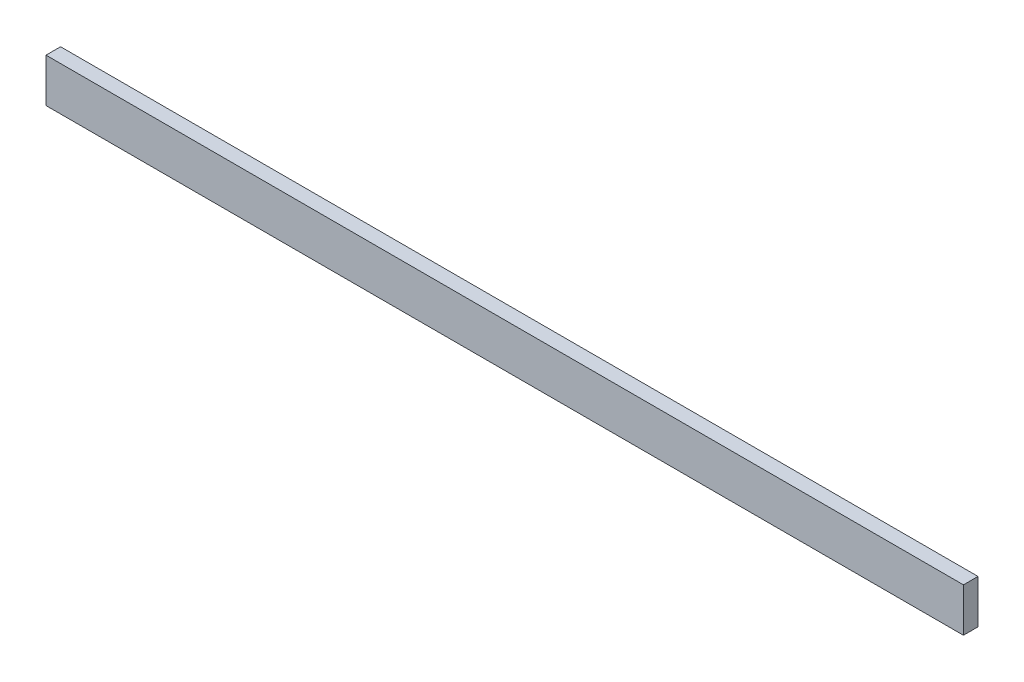
ISO-10303-21;
HEADER;
FILE_DESCRIPTION(('STEP AP214'),'2;1');
FILE_NAME('part.step','',(''),(''),'','','');
FILE_SCHEMA(('AUTOMOTIVE_DESIGN { 1 0 10303 214 1 1 1 1 }'));
ENDSEC;
DATA;
#1=APPLICATION_CONTEXT('core data for automotive mechanical design processes');
#2=APPLICATION_PROTOCOL_DEFINITION('international standard','automotive_design',2000,#1);
#3=PRODUCT_CONTEXT('',#1,'mechanical');
#4=PRODUCT('Part','Part','',(#3));
#5=PRODUCT_RELATED_PRODUCT_CATEGORY('part','',(#4));
#6=PRODUCT_DEFINITION_FORMATION('','',#4);
#7=PRODUCT_DEFINITION_CONTEXT('part definition',#1,'design');
#8=PRODUCT_DEFINITION('design','',#6,#7);
#9=PRODUCT_DEFINITION_SHAPE('','',#8);
#10=(LENGTH_UNIT() NAMED_UNIT(*) SI_UNIT(.MILLI.,.METRE.));
#11=(NAMED_UNIT(*) PLANE_ANGLE_UNIT() SI_UNIT($,.RADIAN.));
#12=(NAMED_UNIT(*) SI_UNIT($,.STERADIAN.) SOLID_ANGLE_UNIT());
#13=UNCERTAINTY_MEASURE_WITH_UNIT(LENGTH_MEASURE(1.E-05),#10,'distance_accuracy_value','');
#14=(GEOMETRIC_REPRESENTATION_CONTEXT(3) GLOBAL_UNCERTAINTY_ASSIGNED_CONTEXT((#13)) GLOBAL_UNIT_ASSIGNED_CONTEXT((#10,
#11,#12)) REPRESENTATION_CONTEXT('',''));
#15=CARTESIAN_POINT('',(0.,0.,0.));
#16=DIRECTION('',(0.,0.,1.));
#17=DIRECTION('',(1.,0.,0.));
#18=AXIS2_PLACEMENT_3D('',#15,#16,#17);
#19=CARTESIAN_POINT('',(0.,0.,6.35));
#20=DIRECTION('',(-1.,0.,0.));
#21=DIRECTION('',(0.,0.,1.));
#22=AXIS2_PLACEMENT_3D('',#19,#20,#21);
#23=PLANE('',#22);
#24=DIRECTION('',(0.,1.,0.));
#25=VECTOR('',#24,1.);
#26=CARTESIAN_POINT('',(0.,0.,0.));
#27=LINE('',#26,#25);
#28=CARTESIAN_POINT('',(0.,0.,0.));
#29=VERTEX_POINT('',#28);
#30=CARTESIAN_POINT('',(0.,19.05,0.));
#31=VERTEX_POINT('',#30);
#32=EDGE_CURVE('E110',#29,#31,#27,.T.);
#33=ORIENTED_EDGE('',*,*,#32,.F.);
#34=DIRECTION('',(0.,0.,-1.));
#35=VECTOR('',#34,1.);
#36=CARTESIAN_POINT('',(0.,0.,6.35));
#37=LINE('',#36,#35);
#38=CARTESIAN_POINT('',(0.,0.,6.35));
#39=VERTEX_POINT('',#38);
#40=EDGE_CURVE('E11',#39,#29,#37,.T.);
#41=ORIENTED_EDGE('',*,*,#40,.F.);
#42=DIRECTION('',(0.,1.,0.));
#43=VECTOR('',#42,1.);
#44=CARTESIAN_POINT('',(0.,0.,6.35));
#45=LINE('',#44,#43);
#46=CARTESIAN_POINT('',(0.,19.05,6.35));
#47=VERTEX_POINT('',#46);
#48=EDGE_CURVE('E103',#39,#47,#45,.T.);
#49=ORIENTED_EDGE('',*,*,#48,.T.);
#50=DIRECTION('',(0.,0.,-1.));
#51=VECTOR('',#50,1.);
#52=CARTESIAN_POINT('',(0.,19.05,6.35));
#53=LINE('',#52,#51);
#54=EDGE_CURVE('E42',#47,#31,#53,.T.);
#55=ORIENTED_EDGE('',*,*,#54,.T.);
#56=EDGE_LOOP('',(#33,#41,#49,#55));
#57=FACE_BOUND('',#56,.T.);
#58=ADVANCED_FACE('F39',(#57),#23,.T.);
#59=CARTESIAN_POINT('',(0.,0.,6.35));
#60=DIRECTION('',(0.,1.,0.));
#61=DIRECTION('',(0.,0.,1.));
#62=AXIS2_PLACEMENT_3D('',#59,#60,#61);
#63=PLANE('',#62);
#64=DIRECTION('',(1.,0.,0.));
#65=VECTOR('',#64,1.);
#66=CARTESIAN_POINT('',(0.,0.,0.));
#67=LINE('',#66,#65);
#68=CARTESIAN_POINT('',(400.05,0.,0.));
#69=VERTEX_POINT('',#68);
#70=EDGE_CURVE('E73',#29,#69,#67,.T.);
#71=ORIENTED_EDGE('',*,*,#70,.T.);
#72=DIRECTION('',(0.,0.,-1.));
#73=VECTOR('',#72,1.);
#74=CARTESIAN_POINT('',(400.05,0.,6.35));
#75=LINE('',#74,#73);
#76=CARTESIAN_POINT('',(400.05,0.,6.35));
#77=VERTEX_POINT('',#76);
#78=EDGE_CURVE('E49',#77,#69,#75,.T.);
#79=ORIENTED_EDGE('',*,*,#78,.F.);
#80=DIRECTION('',(1.,0.,0.));
#81=VECTOR('',#80,1.);
#82=CARTESIAN_POINT('',(0.,0.,6.35));
#83=LINE('',#82,#81);
#84=EDGE_CURVE('E90',#39,#77,#83,.T.);
#85=ORIENTED_EDGE('',*,*,#84,.F.);
#86=ORIENTED_EDGE('',*,*,#40,.T.);
#87=EDGE_LOOP('',(#71,#79,#85,#86));
#88=FACE_BOUND('',#87,.T.);
#89=ADVANCED_FACE('F126',(#88),#63,.F.);
#90=CARTESIAN_POINT('',(400.05,0.,6.35));
#91=DIRECTION('',(-1.,0.,0.));
#92=DIRECTION('',(0.,0.,1.));
#93=AXIS2_PLACEMENT_3D('',#90,#91,#92);
#94=PLANE('',#93);
#95=DIRECTION('',(0.,1.,0.));
#96=VECTOR('',#95,1.);
#97=CARTESIAN_POINT('',(400.05,0.,0.));
#98=LINE('',#97,#96);
#99=CARTESIAN_POINT('',(400.05,19.05,0.));
#100=VERTEX_POINT('',#99);
#101=EDGE_CURVE('E98',#69,#100,#98,.T.);
#102=ORIENTED_EDGE('',*,*,#101,.T.);
#103=DIRECTION('',(0.,0.,-1.));
#104=VECTOR('',#103,1.);
#105=CARTESIAN_POINT('',(400.05,19.05,6.35));
#106=LINE('',#105,#104);
#107=CARTESIAN_POINT('',(400.05,19.05,6.35));
#108=VERTEX_POINT('',#107);
#109=EDGE_CURVE('E95',#108,#100,#106,.T.);
#110=ORIENTED_EDGE('',*,*,#109,.F.);
#111=DIRECTION('',(0.,1.,0.));
#112=VECTOR('',#111,1.);
#113=CARTESIAN_POINT('',(400.05,0.,6.35));
#114=LINE('',#113,#112);
#115=EDGE_CURVE('E85',#77,#108,#114,.T.);
#116=ORIENTED_EDGE('',*,*,#115,.F.);
#117=ORIENTED_EDGE('',*,*,#78,.T.);
#118=EDGE_LOOP('',(#102,#110,#116,#117));
#119=FACE_BOUND('',#118,.T.);
#120=ADVANCED_FACE('F96',(#119),#94,.F.);
#121=CARTESIAN_POINT('',(0.,19.05,6.35));
#122=DIRECTION('',(0.,1.,0.));
#123=DIRECTION('',(0.,0.,1.));
#124=AXIS2_PLACEMENT_3D('',#121,#122,#123);
#125=PLANE('',#124);
#126=DIRECTION('',(1.,0.,0.));
#127=VECTOR('',#126,1.);
#128=CARTESIAN_POINT('',(0.,19.05,0.));
#129=LINE('',#128,#127);
#130=EDGE_CURVE('E114',#31,#100,#129,.T.);
#131=ORIENTED_EDGE('',*,*,#130,.F.);
#132=ORIENTED_EDGE('',*,*,#54,.F.);
#133=DIRECTION('',(1.,0.,0.));
#134=VECTOR('',#133,1.);
#135=CARTESIAN_POINT('',(0.,19.05,6.35));
#136=LINE('',#135,#134);
#137=EDGE_CURVE('E89',#47,#108,#136,.T.);
#138=ORIENTED_EDGE('',*,*,#137,.T.);
#139=ORIENTED_EDGE('',*,*,#109,.T.);
#140=EDGE_LOOP('',(#131,#132,#138,#139));
#141=FACE_BOUND('',#140,.T.);
#142=ADVANCED_FACE('F101',(#141),#125,.T.);
#143=CARTESIAN_POINT('',(0.,0.,6.35));
#144=DIRECTION('',(0.,0.,-1.));
#145=DIRECTION('',(-1.,0.,0.));
#146=AXIS2_PLACEMENT_3D('',#143,#144,#145);
#147=PLANE('',#146);
#148=ORIENTED_EDGE('',*,*,#48,.F.);
#149=ORIENTED_EDGE('',*,*,#84,.T.);
#150=ORIENTED_EDGE('',*,*,#115,.T.);
#151=ORIENTED_EDGE('',*,*,#137,.F.);
#152=EDGE_LOOP('',(#148,#149,#150,#151));
#153=FACE_BOUND('',#152,.T.);
#154=ADVANCED_FACE('F88',(#153),#147,.F.);
#155=CARTESIAN_POINT('',(0.,0.,0.));
#156=DIRECTION('',(0.,0.,-1.));
#157=DIRECTION('',(-1.,0.,0.));
#158=AXIS2_PLACEMENT_3D('',#155,#156,#157);
#159=PLANE('',#158);
#160=ORIENTED_EDGE('',*,*,#32,.T.);
#161=ORIENTED_EDGE('',*,*,#130,.T.);
#162=ORIENTED_EDGE('',*,*,#101,.F.);
#163=ORIENTED_EDGE('',*,*,#70,.F.);
#164=EDGE_LOOP('',(#160,#161,#162,#163));
#165=FACE_BOUND('',#164,.T.);
#166=ADVANCED_FACE('F123',(#165),#159,.T.);
#167=CLOSED_SHELL('',(#58,#89,#120,#142,#154,#166));
#168=MANIFOLD_SOLID_BREP('B2',#167);
#169=ADVANCED_BREP_SHAPE_REPRESENTATION('',(#18,#168),#14);
#170=SHAPE_DEFINITION_REPRESENTATION(#9,#169);
ENDSEC;
END-ISO-10303-21;
